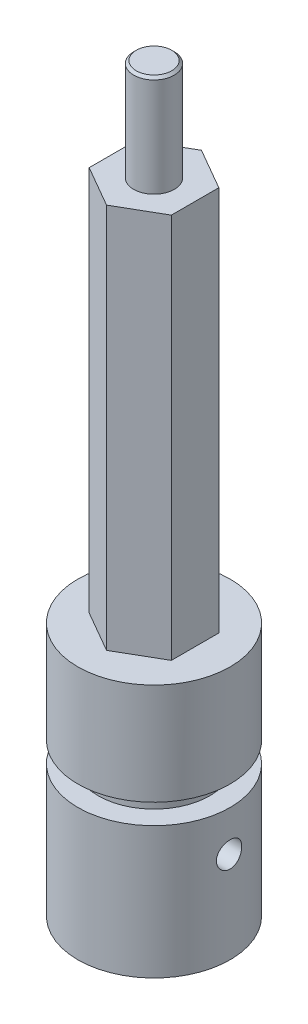
ISO-10303-21;
HEADER;
FILE_DESCRIPTION(('STEP AP214'),'2;1');
FILE_NAME('part.step','',(''),(''),'','','');
FILE_SCHEMA(('AUTOMOTIVE_DESIGN { 1 0 10303 214 1 1 1 1 }'));
ENDSEC;
DATA;
#1=APPLICATION_CONTEXT('core data for automotive mechanical design processes');
#2=APPLICATION_PROTOCOL_DEFINITION('international standard','automotive_design',2000,#1);
#3=PRODUCT_CONTEXT('',#1,'mechanical');
#4=PRODUCT('Part','Part','',(#3));
#5=PRODUCT_RELATED_PRODUCT_CATEGORY('part','',(#4));
#6=PRODUCT_DEFINITION_FORMATION('','',#4);
#7=PRODUCT_DEFINITION_CONTEXT('part definition',#1,'design');
#8=PRODUCT_DEFINITION('design','',#6,#7);
#9=PRODUCT_DEFINITION_SHAPE('','',#8);
#10=(LENGTH_UNIT() NAMED_UNIT(*) SI_UNIT(.MILLI.,.METRE.));
#11=(NAMED_UNIT(*) PLANE_ANGLE_UNIT() SI_UNIT($,.RADIAN.));
#12=(NAMED_UNIT(*) SI_UNIT($,.STERADIAN.) SOLID_ANGLE_UNIT());
#13=UNCERTAINTY_MEASURE_WITH_UNIT(LENGTH_MEASURE(1.E-05),#10,'distance_accuracy_value','');
#14=(GEOMETRIC_REPRESENTATION_CONTEXT(3) GLOBAL_UNCERTAINTY_ASSIGNED_CONTEXT((#13)) GLOBAL_UNIT_ASSIGNED_CONTEXT((#10,
#11,#12)) REPRESENTATION_CONTEXT('',''));
#15=CARTESIAN_POINT('',(0.,0.,0.));
#16=DIRECTION('',(0.,0.,1.));
#17=DIRECTION('',(1.,0.,0.));
#18=AXIS2_PLACEMENT_3D('',#15,#16,#17);
#19=CARTESIAN_POINT('',(0.,25.,0.));
#20=DIRECTION('',(0.,-1.,0.));
#21=DIRECTION('',(0.,0.,-1.));
#22=AXIS2_PLACEMENT_3D('',#19,#20,#21);
#23=CYLINDRICAL_SURFACE('',#22,7.5);
#24=CARTESIAN_POINT('',(0.,25.,0.));
#25=DIRECTION('',(0.,1.,0.));
#26=DIRECTION('',(0.,0.,1.));
#27=AXIS2_PLACEMENT_3D('',#24,#25,#26);
#28=CIRCLE('',#27,7.5);
#29=CARTESIAN_POINT('',(0.,25.,7.5));
#30=VERTEX_POINT('',#29);
#31=EDGE_CURVE('E148',#30,#30,#28,.T.);
#32=ORIENTED_EDGE('',*,*,#31,.F.);
#33=EDGE_LOOP('',(#32));
#34=FACE_BOUND('',#33,.T.);
#35=CARTESIAN_POINT('',(0.,15.,0.));
#36=DIRECTION('',(0.,-1.,0.));
#37=DIRECTION('',(0.,0.,-1.));
#38=AXIS2_PLACEMENT_3D('',#35,#36,#37);
#39=CIRCLE('',#38,7.5);
#40=CARTESIAN_POINT('',(0.,15.,-7.5));
#41=VERTEX_POINT('',#40);
#42=EDGE_CURVE('E218',#41,#41,#39,.T.);
#43=ORIENTED_EDGE('',*,*,#42,.F.);
#44=EDGE_LOOP('',(#43));
#45=FACE_BOUND('',#44,.T.);
#46=ADVANCED_FACE('F39',(#34,#45),#23,.T.);
#47=CARTESIAN_POINT('',(0.,63.,0.));
#48=DIRECTION('',(0.,1.,0.));
#49=DIRECTION('',(0.,0.,1.));
#50=AXIS2_PLACEMENT_3D('',#47,#48,#49);
#51=PLANE('',#50);
#52=DIRECTION('',(0.866025403784439,0.,0.5));
#53=VECTOR('',#52,1.);
#54=CARTESIAN_POINT('',(-4.05,63.,2.33826859021798));
#55=LINE('',#54,#53);
#56=CARTESIAN_POINT('',(-4.05,63.,2.33826859021798));
#57=VERTEX_POINT('',#56);
#58=CARTESIAN_POINT('',(0.,63.,4.67653718043597));
#59=VERTEX_POINT('',#58);
#60=EDGE_CURVE('E138',#57,#59,#55,.T.);
#61=ORIENTED_EDGE('',*,*,#60,.T.);
#62=DIRECTION('',(0.866025403784439,0.,-0.5));
#63=VECTOR('',#62,1.);
#64=CARTESIAN_POINT('',(0.,63.,4.67653718043597));
#65=LINE('',#64,#63);
#66=CARTESIAN_POINT('',(4.05,63.,2.33826859021799));
#67=VERTEX_POINT('',#66);
#68=EDGE_CURVE('E92',#59,#67,#65,.T.);
#69=ORIENTED_EDGE('',*,*,#68,.T.);
#70=DIRECTION('',(0.,0.,-1.));
#71=VECTOR('',#70,1.);
#72=CARTESIAN_POINT('',(4.05,63.,2.33826859021799));
#73=LINE('',#72,#71);
#74=CARTESIAN_POINT('',(4.05,63.,-2.33826859021799));
#75=VERTEX_POINT('',#74);
#76=EDGE_CURVE('E106',#67,#75,#73,.T.);
#77=ORIENTED_EDGE('',*,*,#76,.T.);
#78=DIRECTION('',(-0.866025403784439,0.,-0.5));
#79=VECTOR('',#78,1.);
#80=CARTESIAN_POINT('',(4.05,63.,-2.33826859021799));
#81=LINE('',#80,#79);
#82=CARTESIAN_POINT('',(0.,63.,-4.67653718043597));
#83=VERTEX_POINT('',#82);
#84=EDGE_CURVE('E99',#75,#83,#81,.T.);
#85=ORIENTED_EDGE('',*,*,#84,.T.);
#86=DIRECTION('',(-0.866025403784439,0.,0.5));
#87=VECTOR('',#86,1.);
#88=CARTESIAN_POINT('',(0.,63.,-4.67653718043597));
#89=LINE('',#88,#87);
#90=CARTESIAN_POINT('',(-4.05,63.,-2.33826859021798));
#91=VERTEX_POINT('',#90);
#92=EDGE_CURVE('E104',#83,#91,#89,.T.);
#93=ORIENTED_EDGE('',*,*,#92,.T.);
#94=DIRECTION('',(0.,0.,1.));
#95=VECTOR('',#94,1.);
#96=CARTESIAN_POINT('',(-4.05,63.,-2.33826859021798));
#97=LINE('',#96,#95);
#98=EDGE_CURVE('E64',#91,#57,#97,.T.);
#99=ORIENTED_EDGE('',*,*,#98,.T.);
#100=EDGE_LOOP('',(#61,#69,#77,#85,#93,#99));
#101=FACE_BOUND('',#100,.T.);
#102=CARTESIAN_POINT('',(0.,63.,0.));
#103=DIRECTION('',(0.,1.,0.));
#104=DIRECTION('',(0.,0.,1.));
#105=AXIS2_PLACEMENT_3D('',#102,#103,#104);
#106=CIRCLE('',#105,2.);
#107=CARTESIAN_POINT('',(0.,63.,2.));
#108=VERTEX_POINT('',#107);
#109=EDGE_CURVE('E161',#108,#108,#106,.T.);
#110=ORIENTED_EDGE('',*,*,#109,.F.);
#111=EDGE_LOOP('',(#110));
#112=FACE_BOUND('',#111,.T.);
#113=ADVANCED_FACE('F101',(#101,#112),#51,.T.);
#114=CARTESIAN_POINT('',(0.,25.,0.));
#115=DIRECTION('',(0.,1.,0.));
#116=DIRECTION('',(0.,0.,1.));
#117=AXIS2_PLACEMENT_3D('',#114,#115,#116);
#118=PLANE('',#117);
#119=ORIENTED_EDGE('',*,*,#31,.T.);
#120=EDGE_LOOP('',(#119));
#121=FACE_BOUND('',#120,.T.);
#122=DIRECTION('',(0.866025403784439,0.,-0.5));
#123=VECTOR('',#122,1.);
#124=CARTESIAN_POINT('',(0.,25.,4.67653718043597));
#125=LINE('',#124,#123);
#126=CARTESIAN_POINT('',(0.,25.,4.67653718043597));
#127=VERTEX_POINT('',#126);
#128=CARTESIAN_POINT('',(4.05,25.,2.33826859021799));
#129=VERTEX_POINT('',#128);
#130=EDGE_CURVE('E129',#127,#129,#125,.T.);
#131=ORIENTED_EDGE('',*,*,#130,.F.);
#132=DIRECTION('',(0.866025403784439,0.,0.5));
#133=VECTOR('',#132,1.);
#134=CARTESIAN_POINT('',(-4.05,25.,2.33826859021798));
#135=LINE('',#134,#133);
#136=CARTESIAN_POINT('',(-4.05,25.,2.33826859021798));
#137=VERTEX_POINT('',#136);
#138=EDGE_CURVE('E126',#137,#127,#135,.T.);
#139=ORIENTED_EDGE('',*,*,#138,.F.);
#140=DIRECTION('',(0.,0.,1.));
#141=VECTOR('',#140,1.);
#142=CARTESIAN_POINT('',(-4.05,25.,-2.33826859021798));
#143=LINE('',#142,#141);
#144=CARTESIAN_POINT('',(-4.05,25.,-2.33826859021798));
#145=VERTEX_POINT('',#144);
#146=EDGE_CURVE('E84',#145,#137,#143,.T.);
#147=ORIENTED_EDGE('',*,*,#146,.F.);
#148=DIRECTION('',(-0.866025403784439,0.,0.5));
#149=VECTOR('',#148,1.);
#150=CARTESIAN_POINT('',(0.,25.,-4.67653718043597));
#151=LINE('',#150,#149);
#152=CARTESIAN_POINT('',(0.,25.,-4.67653718043597));
#153=VERTEX_POINT('',#152);
#154=EDGE_CURVE('E135',#153,#145,#151,.T.);
#155=ORIENTED_EDGE('',*,*,#154,.F.);
#156=DIRECTION('',(-0.866025403784439,0.,-0.5));
#157=VECTOR('',#156,1.);
#158=CARTESIAN_POINT('',(4.05,25.,-2.33826859021799));
#159=LINE('',#158,#157);
#160=CARTESIAN_POINT('',(4.05,25.,-2.33826859021799));
#161=VERTEX_POINT('',#160);
#162=EDGE_CURVE('E115',#161,#153,#159,.T.);
#163=ORIENTED_EDGE('',*,*,#162,.F.);
#164=DIRECTION('',(0.,0.,-1.));
#165=VECTOR('',#164,1.);
#166=CARTESIAN_POINT('',(4.05,25.,2.33826859021799));
#167=LINE('',#166,#165);
#168=EDGE_CURVE('E132',#129,#161,#167,.T.);
#169=ORIENTED_EDGE('',*,*,#168,.F.);
#170=EDGE_LOOP('',(#131,#139,#147,#155,#163,#169));
#171=FACE_BOUND('',#170,.T.);
#172=ADVANCED_FACE('F198',(#121,#171),#118,.T.);
#173=CARTESIAN_POINT('',(-4.05,63.,2.33826859021798));
#174=DIRECTION('',(0.5,0.,-0.866025403784439));
#175=DIRECTION('',(-0.866025403784439,0.,-0.5));
#176=AXIS2_PLACEMENT_3D('',#173,#174,#175);
#177=PLANE('',#176);
#178=ORIENTED_EDGE('',*,*,#138,.T.);
#179=DIRECTION('',(0.,-1.,0.));
#180=VECTOR('',#179,1.);
#181=CARTESIAN_POINT('',(0.,63.,4.67653718043597));
#182=LINE('',#181,#180);
#183=EDGE_CURVE('E145',#59,#127,#182,.T.);
#184=ORIENTED_EDGE('',*,*,#183,.F.);
#185=ORIENTED_EDGE('',*,*,#60,.F.);
#186=DIRECTION('',(0.,-1.,0.));
#187=VECTOR('',#186,1.);
#188=CARTESIAN_POINT('',(-4.05,63.,2.33826859021798));
#189=LINE('',#188,#187);
#190=EDGE_CURVE('E122',#57,#137,#189,.T.);
#191=ORIENTED_EDGE('',*,*,#190,.T.);
#192=EDGE_LOOP('',(#178,#184,#185,#191));
#193=FACE_BOUND('',#192,.T.);
#194=ADVANCED_FACE('F257',(#193),#177,.F.);
#195=CARTESIAN_POINT('',(0.,63.,4.67653718043597));
#196=DIRECTION('',(-0.5,0.,-0.866025403784439));
#197=DIRECTION('',(-0.866025403784439,0.,0.5));
#198=AXIS2_PLACEMENT_3D('',#195,#196,#197);
#199=PLANE('',#198);
#200=ORIENTED_EDGE('',*,*,#130,.T.);
#201=DIRECTION('',(0.,-1.,0.));
#202=VECTOR('',#201,1.);
#203=CARTESIAN_POINT('',(4.05,63.,2.33826859021799));
#204=LINE('',#203,#202);
#205=EDGE_CURVE('E142',#67,#129,#204,.T.);
#206=ORIENTED_EDGE('',*,*,#205,.F.);
#207=ORIENTED_EDGE('',*,*,#68,.F.);
#208=ORIENTED_EDGE('',*,*,#183,.T.);
#209=EDGE_LOOP('',(#200,#206,#207,#208));
#210=FACE_BOUND('',#209,.T.);
#211=ADVANCED_FACE('F253',(#210),#199,.F.);
#212=CARTESIAN_POINT('',(4.05,63.,2.33826859021799));
#213=DIRECTION('',(-1.,0.,0.));
#214=DIRECTION('',(0.,0.,1.));
#215=AXIS2_PLACEMENT_3D('',#212,#213,#214);
#216=PLANE('',#215);
#217=ORIENTED_EDGE('',*,*,#168,.T.);
#218=DIRECTION('',(0.,-1.,0.));
#219=VECTOR('',#218,1.);
#220=CARTESIAN_POINT('',(4.05,63.,-2.33826859021799));
#221=LINE('',#220,#219);
#222=EDGE_CURVE('E118',#75,#161,#221,.T.);
#223=ORIENTED_EDGE('',*,*,#222,.F.);
#224=ORIENTED_EDGE('',*,*,#76,.F.);
#225=ORIENTED_EDGE('',*,*,#205,.T.);
#226=EDGE_LOOP('',(#217,#223,#224,#225));
#227=FACE_BOUND('',#226,.T.);
#228=ADVANCED_FACE('F250',(#227),#216,.F.);
#229=CARTESIAN_POINT('',(4.05,63.,-2.33826859021799));
#230=DIRECTION('',(-0.5,0.,0.866025403784439));
#231=DIRECTION('',(0.866025403784439,0.,0.5));
#232=AXIS2_PLACEMENT_3D('',#229,#230,#231);
#233=PLANE('',#232);
#234=ORIENTED_EDGE('',*,*,#162,.T.);
#235=DIRECTION('',(0.,-1.,0.));
#236=VECTOR('',#235,1.);
#237=CARTESIAN_POINT('',(0.,63.,-4.67653718043597));
#238=LINE('',#237,#236);
#239=EDGE_CURVE('E112',#83,#153,#238,.T.);
#240=ORIENTED_EDGE('',*,*,#239,.F.);
#241=ORIENTED_EDGE('',*,*,#84,.F.);
#242=ORIENTED_EDGE('',*,*,#222,.T.);
#243=EDGE_LOOP('',(#234,#240,#241,#242));
#244=FACE_BOUND('',#243,.T.);
#245=ADVANCED_FACE('F113',(#244),#233,.F.);
#246=CARTESIAN_POINT('',(0.,63.,-4.67653718043597));
#247=DIRECTION('',(0.5,0.,0.866025403784439));
#248=DIRECTION('',(0.866025403784439,0.,-0.5));
#249=AXIS2_PLACEMENT_3D('',#246,#247,#248);
#250=PLANE('',#249);
#251=ORIENTED_EDGE('',*,*,#154,.T.);
#252=DIRECTION('',(0.,-1.,0.));
#253=VECTOR('',#252,1.);
#254=CARTESIAN_POINT('',(-4.05,63.,-2.33826859021798));
#255=LINE('',#254,#253);
#256=EDGE_CURVE('E56',#91,#145,#255,.T.);
#257=ORIENTED_EDGE('',*,*,#256,.F.);
#258=ORIENTED_EDGE('',*,*,#92,.F.);
#259=ORIENTED_EDGE('',*,*,#239,.T.);
#260=EDGE_LOOP('',(#251,#257,#258,#259));
#261=FACE_BOUND('',#260,.T.);
#262=ADVANCED_FACE('F120',(#261),#250,.F.);
#263=CARTESIAN_POINT('',(-4.05,63.,-2.33826859021798));
#264=DIRECTION('',(1.,0.,0.));
#265=DIRECTION('',(0.,0.,-1.));
#266=AXIS2_PLACEMENT_3D('',#263,#264,#265);
#267=PLANE('',#266);
#268=ORIENTED_EDGE('',*,*,#146,.T.);
#269=ORIENTED_EDGE('',*,*,#190,.F.);
#270=ORIENTED_EDGE('',*,*,#98,.F.);
#271=ORIENTED_EDGE('',*,*,#256,.T.);
#272=EDGE_LOOP('',(#268,#269,#270,#271));
#273=FACE_BOUND('',#272,.T.);
#274=ADVANCED_FACE('F171',(#273),#267,.F.);
#275=CARTESIAN_POINT('',(0.,73.,0.));
#276=DIRECTION('',(0.,-1.,0.));
#277=DIRECTION('',(0.,0.,-1.));
#278=AXIS2_PLACEMENT_3D('',#275,#276,#277);
#279=CYLINDRICAL_SURFACE('',#278,2.);
#280=CARTESIAN_POINT('',(0.,72.75,0.));
#281=DIRECTION('',(0.,1.,0.));
#282=DIRECTION('',(0.,0.,1.));
#283=AXIS2_PLACEMENT_3D('',#280,#281,#282);
#284=CIRCLE('',#283,2.);
#285=CARTESIAN_POINT('',(0.,72.75,2.));
#286=VERTEX_POINT('',#285);
#287=EDGE_CURVE('E11',#286,#286,#284,.F.);
#288=ORIENTED_EDGE('',*,*,#287,.T.);
#289=EDGE_LOOP('',(#288));
#290=FACE_BOUND('',#289,.T.);
#291=ORIENTED_EDGE('',*,*,#109,.T.);
#292=EDGE_LOOP('',(#291));
#293=FACE_BOUND('',#292,.T.);
#294=ADVANCED_FACE('F167',(#290,#293),#279,.T.);
#295=CARTESIAN_POINT('',(0.,73.,0.));
#296=DIRECTION('',(0.,1.,0.));
#297=DIRECTION('',(0.,0.,1.));
#298=AXIS2_PLACEMENT_3D('',#295,#296,#297);
#299=PLANE('',#298);
#300=CARTESIAN_POINT('',(0.,73.,0.));
#301=DIRECTION('',(0.,1.,0.));
#302=DIRECTION('',(0.,0.,1.));
#303=AXIS2_PLACEMENT_3D('',#300,#301,#302);
#304=CIRCLE('',#303,1.75000000000002);
#305=CARTESIAN_POINT('',(0.,73.,1.75000000000002));
#306=VERTEX_POINT('',#305);
#307=EDGE_CURVE('E48',#306,#306,#304,.T.);
#308=ORIENTED_EDGE('',*,*,#307,.T.);
#309=EDGE_LOOP('',(#308));
#310=FACE_BOUND('',#309,.T.);
#311=ADVANCED_FACE('F170',(#310),#299,.T.);
#312=CARTESIAN_POINT('',(0.,73.,0.));
#313=DIRECTION('',(0.,-1.,0.));
#314=DIRECTION('',(0.,0.,-1.));
#315=AXIS2_PLACEMENT_3D('',#312,#313,#314);
#316=CONICAL_SURFACE('',#315,1.75000000000002,0.785398163397445);
#317=ORIENTED_EDGE('',*,*,#287,.F.);
#318=EDGE_LOOP('',(#317));
#319=FACE_BOUND('',#318,.T.);
#320=ORIENTED_EDGE('',*,*,#307,.F.);
#321=EDGE_LOOP('',(#320));
#322=FACE_BOUND('',#321,.T.);
#323=ADVANCED_FACE('F41',(#319,#322),#316,.T.);
#324=CARTESIAN_POINT('',(9.1198913944574,13.,0.));
#325=DIRECTION('',(0.,1.,0.));
#326=DIRECTION('',(0.,0.,1.));
#327=AXIS2_PLACEMENT_3D('',#324,#325,#326);
#328=PLANE('',#327);
#329=CARTESIAN_POINT('',(0.,13.,0.));
#330=DIRECTION('',(0.,1.,0.));
#331=DIRECTION('',(0.,0.,1.));
#332=AXIS2_PLACEMENT_3D('',#329,#330,#331);
#333=CIRCLE('',#332,5.5);
#334=CARTESIAN_POINT('',(0.,13.,5.5));
#335=VERTEX_POINT('',#334);
#336=EDGE_CURVE('E222',#335,#335,#333,.T.);
#337=ORIENTED_EDGE('',*,*,#336,.F.);
#338=EDGE_LOOP('',(#337));
#339=FACE_BOUND('',#338,.T.);
#340=CARTESIAN_POINT('',(0.,13.,0.));
#341=DIRECTION('',(0.,1.,0.));
#342=DIRECTION('',(0.,0.,1.));
#343=AXIS2_PLACEMENT_3D('',#340,#341,#342);
#344=CIRCLE('',#343,7.5);
#345=CARTESIAN_POINT('',(0.,13.,7.5));
#346=VERTEX_POINT('',#345);
#347=EDGE_CURVE('E43',#346,#346,#344,.T.);
#348=ORIENTED_EDGE('',*,*,#347,.T.);
#349=EDGE_LOOP('',(#348));
#350=FACE_BOUND('',#349,.T.);
#351=ADVANCED_FACE('F176',(#339,#350),#328,.T.);
#352=CARTESIAN_POINT('',(9.1198913944574,15.,0.));
#353=DIRECTION('',(0.,-1.,0.));
#354=DIRECTION('',(0.,0.,-1.));
#355=AXIS2_PLACEMENT_3D('',#352,#353,#354);
#356=PLANE('',#355);
#357=CARTESIAN_POINT('',(0.,15.,0.));
#358=DIRECTION('',(0.,1.,0.));
#359=DIRECTION('',(0.,0.,1.));
#360=AXIS2_PLACEMENT_3D('',#357,#358,#359);
#361=CIRCLE('',#360,5.5);
#362=CARTESIAN_POINT('',(0.,15.,5.5));
#363=VERTEX_POINT('',#362);
#364=EDGE_CURVE('E225',#363,#363,#361,.T.);
#365=ORIENTED_EDGE('',*,*,#364,.T.);
#366=EDGE_LOOP('',(#365));
#367=FACE_BOUND('',#366,.T.);
#368=ORIENTED_EDGE('',*,*,#42,.T.);
#369=EDGE_LOOP('',(#368));
#370=FACE_BOUND('',#369,.T.);
#371=ADVANCED_FACE('F179',(#367,#370),#356,.T.);
#372=CARTESIAN_POINT('',(0.,25.,0.));
#373=DIRECTION('',(0.,1.,0.));
#374=DIRECTION('',(0.,0.,1.));
#375=AXIS2_PLACEMENT_3D('',#372,#373,#374);
#376=CYLINDRICAL_SURFACE('',#375,5.5);
#377=ORIENTED_EDGE('',*,*,#336,.T.);
#378=EDGE_LOOP('',(#377));
#379=FACE_BOUND('',#378,.T.);
#380=ORIENTED_EDGE('',*,*,#364,.F.);
#381=EDGE_LOOP('',(#380));
#382=FACE_BOUND('',#381,.T.);
#383=ADVANCED_FACE('F181',(#379,#382),#376,.T.);
#384=CARTESIAN_POINT('',(0.,15.,0.));
#385=DIRECTION('',(0.,-1.,0.));
#386=DIRECTION('',(0.,0.,-1.));
#387=AXIS2_PLACEMENT_3D('',#384,#385,#386);
#388=PLANE('',#387);
#389=CARTESIAN_POINT('',(0.,15.,0.));
#390=DIRECTION('',(0.,-1.,0.));
#391=DIRECTION('',(0.,0.,-1.));
#392=AXIS2_PLACEMENT_3D('',#389,#390,#391);
#393=CIRCLE('',#392,3.);
#394=CARTESIAN_POINT('',(0.,15.,-3.));
#395=VERTEX_POINT('',#394);
#396=EDGE_CURVE('E130',#395,#395,#393,.T.);
#397=ORIENTED_EDGE('',*,*,#396,.T.);
#398=EDGE_LOOP('',(#397));
#399=FACE_BOUND('',#398,.T.);
#400=ADVANCED_FACE('F184',(#399),#388,.T.);
#401=CARTESIAN_POINT('',(0.,15.,0.));
#402=DIRECTION('',(0.,-1.,0.));
#403=DIRECTION('',(0.,0.,-1.));
#404=AXIS2_PLACEMENT_3D('',#401,#402,#403);
#405=CYLINDRICAL_SURFACE('',#404,3.);
#406=CARTESIAN_POINT('',(0.,0.,0.));
#407=DIRECTION('',(0.,-1.,0.));
#408=DIRECTION('',(0.,0.,-1.));
#409=AXIS2_PLACEMENT_3D('',#406,#407,#408);
#410=CIRCLE('',#409,3.);
#411=CARTESIAN_POINT('',(0.,0.,-3.));
#412=VERTEX_POINT('',#411);
#413=EDGE_CURVE('E233',#412,#412,#410,.T.);
#414=ORIENTED_EDGE('',*,*,#413,.T.);
#415=EDGE_LOOP('',(#414));
#416=FACE_BOUND('',#415,.T.);
#417=ORIENTED_EDGE('',*,*,#396,.F.);
#418=EDGE_LOOP('',(#417));
#419=FACE_BOUND('',#418,.T.);
#420=CARTESIAN_POINT('',(2.72717802865893,9.,1.24999999999999));
#421=CARTESIAN_POINT('',(2.7271851956322,9.06667189089685,1.24999259066567));
#422=CARTESIAN_POINT('',(2.729658595344,9.13345265682622,1.24463203881502));
#423=CARTESIAN_POINT('',(2.73923833650884,9.26508694205714,1.22339678947784));
#424=CARTESIAN_POINT('',(2.74635725824267,9.32993472667524,1.20749354003276));
#425=CARTESIAN_POINT('',(2.76426917574768,9.45556112969107,1.1658998841945));
#426=CARTESIAN_POINT('',(2.77504717562616,9.51635516371502,1.14024937431427));
#427=CARTESIAN_POINT('',(2.79904148565793,9.63275944957805,1.08000637754462));
#428=CARTESIAN_POINT('',(2.81225721880783,9.68837092343312,1.04541600591531));
#429=CARTESIAN_POINT('',(2.84055762619857,9.79632572497347,0.965973882676162));
#430=CARTESIAN_POINT('',(2.85570568079146,9.84830755874409,0.920653238184404));
#431=CARTESIAN_POINT('',(2.88564295372227,9.94420022249755,0.822021675745546));
#432=CARTESIAN_POINT('',(2.90043203180789,9.98810794061301,0.768707691374));
#433=CARTESIAN_POINT('',(2.92875537930613,10.0684495308793,0.652763393797345));
#434=CARTESIAN_POINT('',(2.94220739975291,10.1044766280323,0.589829293683656));
#435=CARTESIAN_POINT('',(2.96556519993426,10.1652760205056,0.458132022362351));
#436=CARTESIAN_POINT('',(2.97547255347157,10.1900533119642,0.389371454872122));
#437=CARTESIAN_POINT('',(2.99017521042367,10.2263394587567,0.251768498025164));
#438=CARTESIAN_POINT('',(2.99520971127466,10.238471694902,0.18311657619608));
#439=CARTESIAN_POINT('',(3.00046828611204,10.2511376411599,0.044579180365006));
#440=CARTESIAN_POINT('',(3.00069431131015,10.251676055883,-0.0253057817645162));
#441=CARTESIAN_POINT('',(2.99645129133057,10.2414657190667,-0.159792780112567));
#442=CARTESIAN_POINT('',(2.99226714648664,10.2314018994743,-0.224457488607313));
#443=CARTESIAN_POINT('',(2.98006516750309,10.2014468973618,-0.351082893931455));
#444=CARTESIAN_POINT('',(2.97204705074577,10.1815549903698,-0.413043391054914));
#445=CARTESIAN_POINT('',(2.95279852414029,10.1322719591054,-0.533638118077524));
#446=CARTESIAN_POINT('',(2.94152097126085,10.1027405371292,-0.592207177074904));
#447=CARTESIAN_POINT('',(2.91685713989805,10.0351542432997,-0.70371176728196));
#448=CARTESIAN_POINT('',(2.90347011666255,9.99709635915501,-0.756645297756971));
#449=CARTESIAN_POINT('',(2.87481698777061,9.91041757959538,-0.85934091170792));
#450=CARTESIAN_POINT('',(2.8594849435601,9.86124120872099,-0.908616437316237));
#451=CARTESIAN_POINT('',(2.8293786068147,9.75528855929342,-0.998431414927663));
#452=CARTESIAN_POINT('',(2.8146045313137,9.6985093617079,-1.03896749582431));
#453=CARTESIAN_POINT('',(2.78681612355339,9.57660496333809,-1.11140189250063));
#454=CARTESIAN_POINT('',(2.77387558556715,9.51126679425672,-1.1429725335554));
#455=CARTESIAN_POINT('',(2.75209844221011,9.3755189550255,-1.19446432058391));
#456=CARTESIAN_POINT('',(2.74325890334594,9.30511295173045,-1.21439379627312));
#457=CARTESIAN_POINT('',(2.73141212519724,9.166103191086,-1.24080025168121));
#458=CARTESIAN_POINT('',(2.72806369197117,9.09767887774095,-1.24806614632865));
#459=CARTESIAN_POINT('',(2.72660286810642,8.9605215175885,-1.25125630518998));
#460=CARTESIAN_POINT('',(2.72848866599319,8.89178858580829,-1.24718449318148));
#461=CARTESIAN_POINT('',(2.73693131345749,8.76060161456956,-1.22853477565555));
#462=CARTESIAN_POINT('',(2.74318138016618,8.6980273132132,-1.21464618818048));
#463=CARTESIAN_POINT('',(2.75925630297447,8.57614870350213,-1.17767058564225));
#464=CARTESIAN_POINT('',(2.76908199460161,8.51684516316929,-1.15458142053124));
#465=CARTESIAN_POINT('',(2.79170797857,8.40038468964353,-1.09877520805186));
#466=CARTESIAN_POINT('',(2.80461662202282,8.34342502538968,-1.06569183306197));
#467=CARTESIAN_POINT('',(2.83180003740794,8.23559194750098,-0.991200784385964));
#468=CARTESIAN_POINT('',(2.84607539920583,8.18472118329814,-0.949789507875981));
#469=CARTESIAN_POINT('',(2.87578619784533,8.086199865116,-0.855844455715499));
#470=CARTESIAN_POINT('',(2.89122146708842,8.03914860004935,-0.802679661479733));
#471=CARTESIAN_POINT('',(2.92043361183923,7.95452770802068,-0.688851512553534));
#472=CARTESIAN_POINT('',(2.93421036577014,7.91695877593631,-0.628187608803651));
#473=CARTESIAN_POINT('',(2.9586425158565,7.85241012455643,-0.50065468080338));
#474=CARTESIAN_POINT('',(2.96928983138826,7.82545775871053,-0.433770169638503));
#475=CARTESIAN_POINT('',(2.98618173103366,7.78338320766558,-0.295858835154414));
#476=CARTESIAN_POINT('',(2.9924289351992,7.76825398177394,-0.224834504225192));
#477=CARTESIAN_POINT('',(2.9995153479751,7.7511418744797,-0.0860165335064084));
#478=CARTESIAN_POINT('',(3.00070204534225,7.74831400030304,-0.0183440847938955));
#479=CARTESIAN_POINT('',(2.99849523480953,7.75361314129395,0.116486811714287));
#480=CARTESIAN_POINT('',(2.99510252984313,7.76173823601288,0.183645347541156));
#481=CARTESIAN_POINT('',(2.98430065981734,7.78810607215867,0.313086482449185));
#482=CARTESIAN_POINT('',(2.97703824209233,7.80597968046956,0.375457537843569));
#483=CARTESIAN_POINT('',(2.95929499847058,7.85093424720914,0.496292230501331));
#484=CARTESIAN_POINT('',(2.94881356124207,7.87801695466491,0.554755122985826));
#485=CARTESIAN_POINT('',(2.92505825398663,7.94198952921447,0.66902456547878));
#486=CARTESIAN_POINT('',(2.91167959188766,7.979267301424,0.72459165797668));
#487=CARTESIAN_POINT('',(2.88371561874231,8.0620071828719,0.828918675638779));
#488=CARTESIAN_POINT('',(2.86912986083797,8.10747233040676,0.87767606178604));
#489=CARTESIAN_POINT('',(2.83914845259141,8.20894482585441,0.970449787231577));
#490=CARTESIAN_POINT('',(2.82376522857896,8.26545901462113,1.01391775364847));
#491=CARTESIAN_POINT('',(2.79495552690186,8.3854587406802,1.09083332306674));
#492=CARTESIAN_POINT('',(2.78153014522558,8.44894814805815,1.12427532456754));
#493=CARTESIAN_POINT('',(2.75842557732643,8.58094383502276,1.17982766043577));
#494=CARTESIAN_POINT('',(2.74872654469865,8.64942115879321,1.20199823632853));
#495=CARTESIAN_POINT('',(2.73440803066668,8.78953957385067,1.23423556453801));
#496=CARTESIAN_POINT('',(2.72977151604981,8.8611692072743,1.24434291521209));
#497=CARTESIAN_POINT('',(2.72744979732688,8.95535852426189,1.24940464923649));
#498=CARTESIAN_POINT('',(2.72717562860875,8.97767315738804,1.25000248121118));
#499=CARTESIAN_POINT('',(2.72717802865893,9.,1.24999999999999));
#500=B_SPLINE_CURVE_WITH_KNOTS('',3,(#420,#421,#422,#423,#424,#425,#426,#427,#428,#429,#430,
#431,#432,#433,#434,#435,#436,#437,#438,#439,#440,#441,#442,#443,#444,#445,#446,#447,#448,#449,
#450,#451,#452,#453,#454,#455,#456,#457,#458,#459,#460,#461,#462,#463,#464,#465,#466,#467,#468,
#469,#470,#471,#472,#473,#474,#475,#476,#477,#478,#479,#480,#481,#482,#483,#484,#485,#486,#487,
#488,#489,#490,#491,#492,#493,#494,#495,#496,#497,#498,#499),.UNSPECIFIED.,.T.,.F.,(4,2,2,2,2,2,
2,2,2,2,2,2,2,2,2,2,2,2,2,2,2,2,2,2,2,2,2,2,2,2,2,2,2,2,2,2,2,2,2,4),(0.,0.199951711985515,
0.400447161842174,0.600130652152111,0.799766938550096,1.01066841430653,1.2216510045991,
1.44178476577923,1.6618206677489,1.87040605977951,2.07890680917929,2.27471840245092,
2.47054443201882,2.66935814640064,2.86824221022483,3.08114531844483,3.29413040441365,
3.5141154566672,3.73394290745567,3.93950778306306,4.14500152518447,4.3373390106619,
4.52972146913528,4.73025126818167,4.93086800795463,5.14781662735511,5.36478114041864,
5.58230105955592,5.79969134643005,6.00188635094051,6.20404590801911,6.39903415036485,
6.5940594463217,6.79789862829034,7.00181361048901,7.21960426908074,7.43751638139186,
7.65425125796861,7.87025464546159,7.93721375436702),.UNSPECIFIED.);
#501=CARTESIAN_POINT('',(2.72717802865893,9.,1.24999999999999));
#502=VERTEX_POINT('',#501);
#503=EDGE_CURVE('E153',#502,#502,#500,.T.);
#504=ORIENTED_EDGE('',*,*,#503,.F.);
#505=EDGE_LOOP('',(#504));
#506=FACE_BOUND('',#505,.T.);
#507=ADVANCED_FACE('F239',(#416,#419,#506),#405,.F.);
#508=CARTESIAN_POINT('',(2.5,9.,0.));
#509=DIRECTION('',(-1.,0.,0.));
#510=DIRECTION('',(0.,0.,1.));
#511=AXIS2_PLACEMENT_3D('',#508,#509,#510);
#512=CYLINDRICAL_SURFACE('',#511,1.24999999999999);
#513=ORIENTED_EDGE('',*,*,#503,.T.);
#514=EDGE_LOOP('',(#513));
#515=FACE_BOUND('',#514,.T.);
#516=CARTESIAN_POINT('',(7.39509972887452,9.,1.24999999999999));
#517=CARTESIAN_POINT('',(7.39510098700638,9.06968787407301,1.2499971992105));
#518=CARTESIAN_POINT('',(7.39609546274033,9.13941380301244,1.24415258451865));
#519=CARTESIAN_POINT('',(7.39996228684089,9.27690927161008,1.22093871403769));
#520=CARTESIAN_POINT('',(7.40283636695714,9.34467694687476,1.20355883015482));
#521=CARTESIAN_POINT('',(7.41012804661162,9.47624614167839,1.15781477183357));
#522=CARTESIAN_POINT('',(7.41454435585975,9.54005092433315,1.12945977746554));
#523=CARTESIAN_POINT('',(7.4244213605717,9.66199047735685,1.06259324844518));
#524=CARTESIAN_POINT('',(7.42988193848737,9.72012588478812,1.02408285675078));
#525=CARTESIAN_POINT('',(7.44129235576304,9.82965642487283,0.937593763483146));
#526=CARTESIAN_POINT('',(7.44724608663534,9.88098756569325,0.889534524466133));
#527=CARTESIAN_POINT('',(7.45893740334729,9.97489665343075,0.785486002347667));
#528=CARTESIAN_POINT('',(7.46467497635985,10.0174740815577,0.729496249574992));
#529=CARTESIAN_POINT('',(7.47532868491235,10.0929072836097,0.610761434974167));
#530=CARTESIAN_POINT('',(7.48023971216138,10.1257035038659,0.54797804072835));
#531=CARTESIAN_POINT('',(7.48864368478577,10.1802605352653,0.417697810861934));
#532=CARTESIAN_POINT('',(7.49213672236337,10.2020220639424,0.350201282039093));
#533=CARTESIAN_POINT('',(7.4972836736219,10.2336962674919,0.21307186317212));
#534=CARTESIAN_POINT('',(7.49895426555452,10.2437164580023,0.143464443339635));
#535=CARTESIAN_POINT('',(7.5003253967139,10.2519578770763,0.00353764276289921));
#536=CARTESIAN_POINT('',(7.50002606984654,10.2501799076236,-0.0667816892644481));
#537=CARTESIAN_POINT('',(7.49750429215695,10.2349593242359,-0.205401092539436));
#538=CARTESIAN_POINT('',(7.49530091846198,10.2216324182954,-0.273714265350068));
#539=CARTESIAN_POINT('',(7.48923989385818,10.1838744628767,-0.407120989805893));
#540=CARTESIAN_POINT('',(7.48538219256606,10.1594430752052,-0.472214443325749));
#541=CARTESIAN_POINT('',(7.47641349255979,10.1000546798423,-0.59767807389132));
#542=CARTESIAN_POINT('',(7.4712968366344,10.0650499939588,-0.658025261509519));
#543=CARTESIAN_POINT('',(7.46037869035748,9.98554358868247,-0.772032764923316));
#544=CARTESIAN_POINT('',(7.45457714459567,9.94104110064459,-0.825692538957933));
#545=CARTESIAN_POINT('',(7.44285134116298,9.84316059669034,-0.925485636723327));
#546=CARTESIAN_POINT('',(7.43692644865521,9.78968145254951,-0.971519751126597));
#547=CARTESIAN_POINT('',(7.42568979892403,9.67570645489209,-1.05397729422403));
#548=CARTESIAN_POINT('',(7.42037804735663,9.61521053665859,-1.0904006342662));
#549=CARTESIAN_POINT('',(7.41096877280908,9.48880417906126,-1.15262221724414));
#550=CARTESIAN_POINT('',(7.40687261651301,9.42288775095395,-1.17840851363961));
#551=CARTESIAN_POINT('',(7.4003809434494,9.28757546384623,-1.2185149354078));
#552=CARTESIAN_POINT('',(7.39798527694161,9.21817991178379,-1.23283607038397));
#553=CARTESIAN_POINT('',(7.39519479711058,9.07876692191894,-1.24946594243963));
#554=CARTESIAN_POINT('',(7.39477642879335,9.00876681014895,-1.25191610395621));
#555=CARTESIAN_POINT('',(7.39592517391181,8.86935666415459,-1.24511135134122));
#556=CARTESIAN_POINT('',(7.39749221065927,8.79994660724302,-1.23585688931232));
#557=CARTESIAN_POINT('',(7.40241343727509,8.66413612040457,-1.20602616746404));
#558=CARTESIAN_POINT('',(7.40575625959174,8.597719430061,-1.18552189532319));
#559=CARTESIAN_POINT('',(7.41384286502751,8.46926491686026,-1.13384909509613));
#560=CARTESIAN_POINT('',(7.41858673195289,8.40722735622455,-1.10267992905046));
#561=CARTESIAN_POINT('',(7.42899564198697,8.28866270279695,-1.03022833661461));
#562=CARTESIAN_POINT('',(7.43466877800174,8.23219171362198,-0.988855282079676));
#563=CARTESIAN_POINT('',(7.44627333339933,8.1269432336525,-0.897294732853985));
#564=CARTESIAN_POINT('',(7.45220477092666,8.07816628444514,-0.847106618192016));
#565=CARTESIAN_POINT('',(7.46373211059132,7.98917405363566,-0.738714035164398));
#566=CARTESIAN_POINT('',(7.46932388172336,7.94905308685774,-0.680431626693093));
#567=CARTESIAN_POINT('',(7.47947556216471,7.87917233649757,-0.557871723974659));
#568=CARTESIAN_POINT('',(7.48403550484988,7.84941221776308,-0.493594423735309));
#569=CARTESIAN_POINT('',(7.49159179084791,7.80124470802258,-0.361149525750661));
#570=CARTESIAN_POINT('',(7.49459492283811,7.78278796213255,-0.293000281301303));
#571=CARTESIAN_POINT('',(7.4987279158464,7.75759220051809,-0.154515367437104));
#572=CARTESIAN_POINT('',(7.49985793100089,7.75085222063383,-0.0841798784108107));
#573=CARTESIAN_POINT('',(7.50011518943913,7.74930905884391,0.055770637886841));
#574=CARTESIAN_POINT('',(7.4992665101212,7.75436237302948,0.12538408030134));
#575=CARTESIAN_POINT('',(7.49571089193641,7.77595196113471,0.262755987157345));
#576=CARTESIAN_POINT('',(7.49300396347501,7.79248817075479,0.330514461983712));
#577=CARTESIAN_POINT('',(7.48603494413793,7.83651908277189,0.462198222959295));
#578=CARTESIAN_POINT('',(7.48177458520777,7.86400158410523,0.52612768607701));
#579=CARTESIAN_POINT('',(7.47216378438676,7.9291289681151,0.64849022649098));
#580=CARTESIAN_POINT('',(7.46681329082441,7.96677433253049,0.706923043058729));
#581=CARTESIAN_POINT('',(7.45553814809486,8.05166754623101,0.817356472763576));
#582=CARTESIAN_POINT('',(7.44960762275367,8.09902047737844,0.869275715302804));
#583=CARTESIAN_POINT('',(7.43788151652376,8.2017641539491,0.964481937974018));
#584=CARTESIAN_POINT('',(7.43208596756801,8.25715677944578,1.00776689335059));
#585=CARTESIAN_POINT('',(7.42124171785049,8.37487266125382,1.0847571354598));
#586=CARTESIAN_POINT('',(7.41619858990617,8.43724216991903,1.11839249454726));
#587=CARTESIAN_POINT('',(7.40749605110885,8.56680461795572,1.17465726822045));
#588=CARTESIAN_POINT('',(7.40383525875637,8.63399266134845,1.1972976776158));
#589=CARTESIAN_POINT('',(7.3991237241889,8.75120188473833,1.22601302656107));
#590=CARTESIAN_POINT('',(7.39762311710509,8.80051340397922,1.23499370883513));
#591=CARTESIAN_POINT('',(7.3956106764326,8.89987674242055,1.24698814759121));
#592=CARTESIAN_POINT('',(7.39509882489388,8.94992854816508,1.25000201239596));
#593=CARTESIAN_POINT('',(7.39509972887452,9.,1.24999999999999));
#594=B_SPLINE_CURVE_WITH_KNOTS('',3,(#516,#517,#518,#519,#520,#521,#522,#523,#524,#525,#526,
#527,#528,#529,#530,#531,#532,#533,#534,#535,#536,#537,#538,#539,#540,#541,#542,#543,#544,#545,
#546,#547,#548,#549,#550,#551,#552,#553,#554,#555,#556,#557,#558,#559,#560,#561,#562,#563,#564,
#565,#566,#567,#568,#569,#570,#571,#572,#573,#574,#575,#576,#577,#578,#579,#580,#581,#582,#583,
#584,#585,#586,#587,#588,#589,#590,#591,#592,#593),.UNSPECIFIED.,.T.,.F.,(4,2,2,2,2,2,2,2,2,2,2,
2,2,2,2,2,2,2,2,2,2,2,2,2,2,2,2,2,2,2,2,2,2,2,2,2,2,2,4),(0.,0.20888051945266,0.417953759959722,
0.626852498915828,0.835727737004603,1.04644579575681,1.25717633915047,1.46916490053541,
1.6811396755338,1.89115783734106,2.10116172324169,2.30908560580157,2.51701582122589,
2.72589802067535,2.93479713111205,3.14623061728884,3.35766605370832,3.56933831247124,
3.7809919296686,3.99011771208027,4.1992354170481,4.40703032315567,4.61483766144609,
4.82456171379172,5.03430052213166,5.24622056515512,5.4581337523617,5.66911492206644,
5.88007872953996,6.08848888130779,6.29689786607232,6.50507519914049,6.71326240193988,
6.92383498729446,7.13445689438726,7.34656863806421,7.55846783368809,7.70855335268464,
7.85863614697491),.UNSPECIFIED.);
#595=CARTESIAN_POINT('',(7.39509972887452,9.,1.24999999999999));
#596=VERTEX_POINT('',#595);
#597=EDGE_CURVE('E160',#596,#596,#594,.T.);
#598=ORIENTED_EDGE('',*,*,#597,.F.);
#599=EDGE_LOOP('',(#598));
#600=FACE_BOUND('',#599,.T.);
#601=ADVANCED_FACE('F162',(#515,#600),#512,.F.);
#602=CARTESIAN_POINT('',(0.,0.,0.));
#603=DIRECTION('',(0.,1.,0.));
#604=DIRECTION('',(0.,0.,1.));
#605=AXIS2_PLACEMENT_3D('',#602,#603,#604);
#606=PLANE('',#605);
#607=ORIENTED_EDGE('',*,*,#413,.F.);
#608=EDGE_LOOP('',(#607));
#609=FACE_BOUND('',#608,.T.);
#610=CARTESIAN_POINT('',(0.,0.,0.));
#611=DIRECTION('',(0.,1.,0.));
#612=DIRECTION('',(0.,0.,1.));
#613=AXIS2_PLACEMENT_3D('',#610,#611,#612);
#614=CIRCLE('',#613,7.5);
#615=CARTESIAN_POINT('',(0.,0.,7.5));
#616=VERTEX_POINT('',#615);
#617=EDGE_CURVE('E147',#616,#616,#614,.T.);
#618=ORIENTED_EDGE('',*,*,#617,.F.);
#619=EDGE_LOOP('',(#618));
#620=FACE_BOUND('',#619,.T.);
#621=ADVANCED_FACE('F204',(#609,#620),#606,.F.);
#622=ORIENTED_EDGE('',*,*,#617,.T.);
#623=EDGE_LOOP('',(#622));
#624=FACE_BOUND('',#623,.T.);
#625=ORIENTED_EDGE('',*,*,#597,.T.);
#626=EDGE_LOOP('',(#625));
#627=FACE_BOUND('',#626,.T.);
#628=ORIENTED_EDGE('',*,*,#347,.F.);
#629=EDGE_LOOP('',(#628));
#630=FACE_BOUND('',#629,.T.);
#631=ADVANCED_FACE('F194',(#624,#627,#630),#23,.T.);
#632=CLOSED_SHELL('',(#46,#113,#172,#194,#211,#228,#245,#262,#274,#294,#311,#323,#351,#371,#383,
#400,#507,#601,#621,#631));
#633=MANIFOLD_SOLID_BREP('B2',#632);
#634=ADVANCED_BREP_SHAPE_REPRESENTATION('',(#18,#633),#14);
#635=SHAPE_DEFINITION_REPRESENTATION(#9,#634);
ENDSEC;
END-ISO-10303-21;
